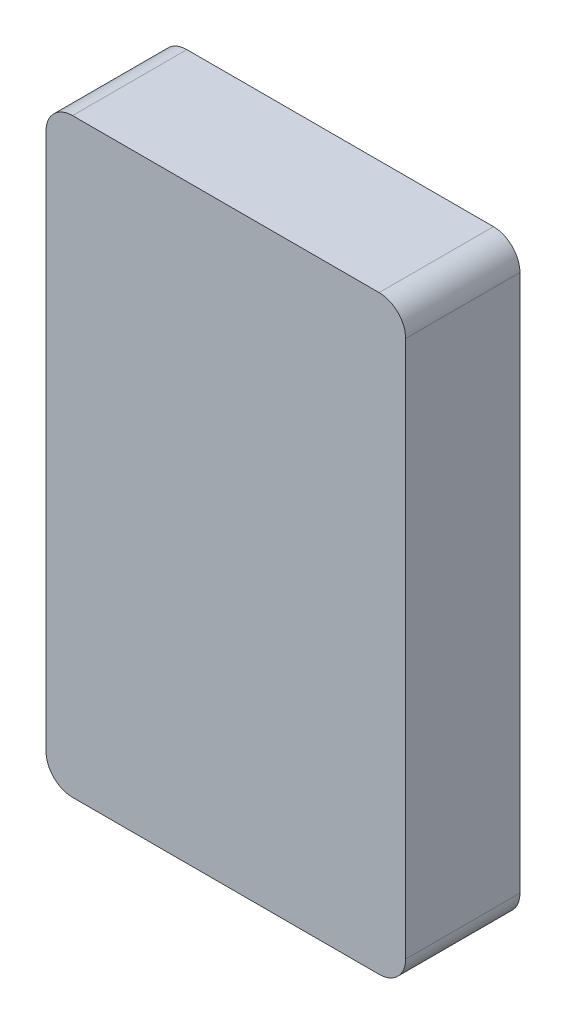
ISO-10303-21;
HEADER;
FILE_DESCRIPTION(('STEP AP214'),'2;1');
FILE_NAME('part.step','',(''),(''),'','','');
FILE_SCHEMA(('AUTOMOTIVE_DESIGN { 1 0 10303 214 1 1 1 1 }'));
ENDSEC;
DATA;
#1=APPLICATION_CONTEXT('core data for automotive mechanical design processes');
#2=APPLICATION_PROTOCOL_DEFINITION('international standard','automotive_design',2000,#1);
#3=PRODUCT_CONTEXT('',#1,'mechanical');
#4=PRODUCT('Part','Part','',(#3));
#5=PRODUCT_RELATED_PRODUCT_CATEGORY('part','',(#4));
#6=PRODUCT_DEFINITION_FORMATION('','',#4);
#7=PRODUCT_DEFINITION_CONTEXT('part definition',#1,'design');
#8=PRODUCT_DEFINITION('design','',#6,#7);
#9=PRODUCT_DEFINITION_SHAPE('','',#8);
#10=(LENGTH_UNIT() NAMED_UNIT(*) SI_UNIT(.MILLI.,.METRE.));
#11=(NAMED_UNIT(*) PLANE_ANGLE_UNIT() SI_UNIT($,.RADIAN.));
#12=(NAMED_UNIT(*) SI_UNIT($,.STERADIAN.) SOLID_ANGLE_UNIT());
#13=UNCERTAINTY_MEASURE_WITH_UNIT(LENGTH_MEASURE(1.E-05),#10,'distance_accuracy_value','');
#14=(GEOMETRIC_REPRESENTATION_CONTEXT(3) GLOBAL_UNCERTAINTY_ASSIGNED_CONTEXT((#13)) GLOBAL_UNIT_ASSIGNED_CONTEXT((#10,
#11,#12)) REPRESENTATION_CONTEXT('',''));
#15=CARTESIAN_POINT('',(0.,0.,0.));
#16=DIRECTION('',(0.,0.,1.));
#17=DIRECTION('',(1.,0.,0.));
#18=AXIS2_PLACEMENT_3D('',#15,#16,#17);
#19=CARTESIAN_POINT('',(-400.,-5.,0.));
#20=DIRECTION('',(0.,0.,1.));
#21=DIRECTION('',(1.,0.,0.));
#22=AXIS2_PLACEMENT_3D('',#19,#20,#21);
#23=PLANE('',#22);
#24=CARTESIAN_POINT('',(-400.,-5.,0.));
#25=DIRECTION('',(0.,0.,1.));
#26=DIRECTION('',(1.,0.,0.));
#27=AXIS2_PLACEMENT_3D('',#24,#25,#26);
#28=CIRCLE('',#27,35.);
#29=CARTESIAN_POINT('',(-435.,-5.00000000000001,0.));
#30=VERTEX_POINT('',#29);
#31=CARTESIAN_POINT('',(-400.,-40.,0.));
#32=VERTEX_POINT('',#31);
#33=EDGE_CURVE('E196',#30,#32,#28,.T.);
#34=ORIENTED_EDGE('',*,*,#33,.F.);
#35=DIRECTION('',(0.,-1.,0.));
#36=VECTOR('',#35,1.);
#37=CARTESIAN_POINT('',(-435.,705.,0.));
#38=LINE('',#37,#36);
#39=CARTESIAN_POINT('',(-435.,705.,0.));
#40=VERTEX_POINT('',#39);
#41=EDGE_CURVE('E56',#40,#30,#38,.T.);
#42=ORIENTED_EDGE('',*,*,#41,.F.);
#43=CARTESIAN_POINT('',(-400.,705.,0.));
#44=DIRECTION('',(0.,0.,1.));
#45=DIRECTION('',(1.,0.,0.));
#46=AXIS2_PLACEMENT_3D('',#43,#44,#45);
#47=CIRCLE('',#46,35.0000000000001);
#48=CARTESIAN_POINT('',(-400.,740.,0.));
#49=VERTEX_POINT('',#48);
#50=EDGE_CURVE('E208',#49,#40,#47,.T.);
#51=ORIENTED_EDGE('',*,*,#50,.F.);
#52=DIRECTION('',(-1.,0.,0.));
#53=VECTOR('',#52,1.);
#54=CARTESIAN_POINT('',(-400.,740.,0.));
#55=LINE('',#54,#53);
#56=CARTESIAN_POINT('',(5.,740.,0.));
#57=VERTEX_POINT('',#56);
#58=EDGE_CURVE('E206',#57,#49,#55,.T.);
#59=ORIENTED_EDGE('',*,*,#58,.F.);
#60=CARTESIAN_POINT('',(5.,705.,0.));
#61=DIRECTION('',(0.,0.,1.));
#62=DIRECTION('',(-1.,0.,0.));
#63=AXIS2_PLACEMENT_3D('',#60,#61,#62);
#64=CIRCLE('',#63,35.0000000000001);
#65=CARTESIAN_POINT('',(40.0000000000001,705.,0.));
#66=VERTEX_POINT('',#65);
#67=EDGE_CURVE('E204',#66,#57,#64,.T.);
#68=ORIENTED_EDGE('',*,*,#67,.F.);
#69=DIRECTION('',(0.,1.,0.));
#70=VECTOR('',#69,1.);
#71=CARTESIAN_POINT('',(40.,705.,0.));
#72=LINE('',#71,#70);
#73=CARTESIAN_POINT('',(40.0000000000001,-5.00000000000005,0.));
#74=VERTEX_POINT('',#73);
#75=EDGE_CURVE('E202',#74,#66,#72,.T.);
#76=ORIENTED_EDGE('',*,*,#75,.F.);
#77=CARTESIAN_POINT('',(5.00000000000012,-5.00000000000005,0.));
#78=DIRECTION('',(0.,0.,1.));
#79=DIRECTION('',(1.,0.,0.));
#80=AXIS2_PLACEMENT_3D('',#77,#78,#79);
#81=CIRCLE('',#80,35.);
#82=CARTESIAN_POINT('',(5.00000000000011,-40.,0.));
#83=VERTEX_POINT('',#82);
#84=EDGE_CURVE('E132',#83,#74,#81,.T.);
#85=ORIENTED_EDGE('',*,*,#84,.F.);
#86=DIRECTION('',(1.,0.,0.));
#87=VECTOR('',#86,1.);
#88=CARTESIAN_POINT('',(-400.,-40.,0.));
#89=LINE('',#88,#87);
#90=EDGE_CURVE('E199',#32,#83,#89,.T.);
#91=ORIENTED_EDGE('',*,*,#90,.F.);
#92=EDGE_LOOP('',(#34,#42,#51,#59,#68,#76,#85,#91));
#93=FACE_BOUND('',#92,.T.);
#94=DIRECTION('',(0.,1.,0.));
#95=VECTOR('',#94,1.);
#96=CARTESIAN_POINT('',(0.,0.,0.));
#97=LINE('',#96,#95);
#98=CARTESIAN_POINT('',(0.,0.,0.));
#99=VERTEX_POINT('',#98);
#100=CARTESIAN_POINT('',(0.,700.,0.));
#101=VERTEX_POINT('',#100);
#102=EDGE_CURVE('E48',#99,#101,#97,.T.);
#103=ORIENTED_EDGE('',*,*,#102,.T.);
#104=DIRECTION('',(-1.,0.,0.));
#105=VECTOR('',#104,1.);
#106=CARTESIAN_POINT('',(0.,700.,0.));
#107=LINE('',#106,#105);
#108=CARTESIAN_POINT('',(-395.,700.,0.));
#109=VERTEX_POINT('',#108);
#110=EDGE_CURVE('E181',#101,#109,#107,.T.);
#111=ORIENTED_EDGE('',*,*,#110,.T.);
#112=DIRECTION('',(0.,-1.,0.));
#113=VECTOR('',#112,1.);
#114=CARTESIAN_POINT('',(-395.,0.,0.));
#115=LINE('',#114,#113);
#116=CARTESIAN_POINT('',(-395.,0.,0.));
#117=VERTEX_POINT('',#116);
#118=EDGE_CURVE('E184',#109,#117,#115,.T.);
#119=ORIENTED_EDGE('',*,*,#118,.T.);
#120=DIRECTION('',(1.,0.,0.));
#121=VECTOR('',#120,1.);
#122=CARTESIAN_POINT('',(0.,0.,0.));
#123=LINE('',#122,#121);
#124=EDGE_CURVE('E170',#117,#99,#123,.T.);
#125=ORIENTED_EDGE('',*,*,#124,.T.);
#126=EDGE_LOOP('',(#103,#111,#119,#125));
#127=FACE_BOUND('',#126,.T.);
#128=ADVANCED_FACE('F33',(#93,#127),#23,.F.);
#129=CARTESIAN_POINT('',(-400.,-5.,150.));
#130=DIRECTION('',(0.,0.,-1.));
#131=DIRECTION('',(-1.,0.,0.));
#132=AXIS2_PLACEMENT_3D('',#129,#130,#131);
#133=CYLINDRICAL_SURFACE('',#132,35.);
#134=ORIENTED_EDGE('',*,*,#33,.T.);
#135=DIRECTION('',(0.,0.,-1.));
#136=VECTOR('',#135,1.);
#137=CARTESIAN_POINT('',(-400.,-40.,150.));
#138=LINE('',#137,#136);
#139=CARTESIAN_POINT('',(-400.,-40.,151.));
#140=VERTEX_POINT('',#139);
#141=EDGE_CURVE('E11',#140,#32,#138,.T.);
#142=ORIENTED_EDGE('',*,*,#141,.F.);
#143=CARTESIAN_POINT('',(-400.,-5.,151.));
#144=DIRECTION('',(0.,0.,1.));
#145=DIRECTION('',(1.,0.,0.));
#146=AXIS2_PLACEMENT_3D('',#143,#144,#145);
#147=CIRCLE('',#146,35.);
#148=CARTESIAN_POINT('',(-435.,-5.,151.));
#149=VERTEX_POINT('',#148);
#150=EDGE_CURVE('E163',#149,#140,#147,.T.);
#151=ORIENTED_EDGE('',*,*,#150,.F.);
#152=DIRECTION('',(0.,0.,-1.));
#153=VECTOR('',#152,1.);
#154=CARTESIAN_POINT('',(-435.,-5.00000000000001,150.));
#155=LINE('',#154,#153);
#156=EDGE_CURVE('E211',#149,#30,#155,.T.);
#157=ORIENTED_EDGE('',*,*,#156,.T.);
#158=EDGE_LOOP('',(#134,#142,#151,#157));
#159=FACE_BOUND('',#158,.T.);
#160=ADVANCED_FACE('F35',(#159),#133,.T.);
#161=CARTESIAN_POINT('',(-400.,-40.,150.));
#162=DIRECTION('',(0.,1.,0.));
#163=DIRECTION('',(-1.,0.,0.));
#164=AXIS2_PLACEMENT_3D('',#161,#162,#163);
#165=PLANE('',#164);
#166=ORIENTED_EDGE('',*,*,#90,.T.);
#167=DIRECTION('',(0.,0.,-1.));
#168=VECTOR('',#167,1.);
#169=CARTESIAN_POINT('',(5.00000000000011,-40.,150.));
#170=LINE('',#169,#168);
#171=CARTESIAN_POINT('',(5.00000000000011,-40.,151.));
#172=VERTEX_POINT('',#171);
#173=EDGE_CURVE('E41',#172,#83,#170,.T.);
#174=ORIENTED_EDGE('',*,*,#173,.F.);
#175=DIRECTION('',(1.,0.,0.));
#176=VECTOR('',#175,1.);
#177=CARTESIAN_POINT('',(-400.,-40.,151.));
#178=LINE('',#177,#176);
#179=EDGE_CURVE('E150',#140,#172,#178,.T.);
#180=ORIENTED_EDGE('',*,*,#179,.F.);
#181=ORIENTED_EDGE('',*,*,#141,.T.);
#182=EDGE_LOOP('',(#166,#174,#180,#181));
#183=FACE_BOUND('',#182,.T.);
#184=ADVANCED_FACE('F240',(#183),#165,.F.);
#185=CARTESIAN_POINT('',(5.00000000000012,-5.00000000000005,150.));
#186=DIRECTION('',(0.,0.,-1.));
#187=DIRECTION('',(-1.,0.,0.));
#188=AXIS2_PLACEMENT_3D('',#185,#186,#187);
#189=CYLINDRICAL_SURFACE('',#188,35.);
#190=ORIENTED_EDGE('',*,*,#84,.T.);
#191=DIRECTION('',(0.,0.,-1.));
#192=VECTOR('',#191,1.);
#193=CARTESIAN_POINT('',(40.0000000000001,-5.00000000000005,150.));
#194=LINE('',#193,#192);
#195=CARTESIAN_POINT('',(40.0000000000001,-5.00000000000005,151.));
#196=VERTEX_POINT('',#195);
#197=EDGE_CURVE('E125',#196,#74,#194,.T.);
#198=ORIENTED_EDGE('',*,*,#197,.F.);
#199=CARTESIAN_POINT('',(5.00000000000012,-5.00000000000005,151.));
#200=DIRECTION('',(0.,0.,1.));
#201=DIRECTION('',(1.,0.,0.));
#202=AXIS2_PLACEMENT_3D('',#199,#200,#201);
#203=CIRCLE('',#202,35.);
#204=EDGE_CURVE('E130',#172,#196,#203,.T.);
#205=ORIENTED_EDGE('',*,*,#204,.F.);
#206=ORIENTED_EDGE('',*,*,#173,.T.);
#207=EDGE_LOOP('',(#190,#198,#205,#206));
#208=FACE_BOUND('',#207,.T.);
#209=ADVANCED_FACE('F127',(#208),#189,.T.);
#210=CARTESIAN_POINT('',(40.,705.,150.));
#211=DIRECTION('',(-1.,0.,0.));
#212=DIRECTION('',(0.,-1.,0.));
#213=AXIS2_PLACEMENT_3D('',#210,#211,#212);
#214=PLANE('',#213);
#215=ORIENTED_EDGE('',*,*,#75,.T.);
#216=DIRECTION('',(0.,0.,-1.));
#217=VECTOR('',#216,1.);
#218=CARTESIAN_POINT('',(40.0000000000001,705.,150.));
#219=LINE('',#218,#217);
#220=CARTESIAN_POINT('',(40.0000000000001,705.,151.));
#221=VERTEX_POINT('',#220);
#222=EDGE_CURVE('E135',#221,#66,#219,.T.);
#223=ORIENTED_EDGE('',*,*,#222,.F.);
#224=DIRECTION('',(0.,1.,0.));
#225=VECTOR('',#224,1.);
#226=CARTESIAN_POINT('',(40.0000000000001,-5.00000000000005,151.));
#227=LINE('',#226,#225);
#228=EDGE_CURVE('E138',#196,#221,#227,.T.);
#229=ORIENTED_EDGE('',*,*,#228,.F.);
#230=ORIENTED_EDGE('',*,*,#197,.T.);
#231=EDGE_LOOP('',(#215,#223,#229,#230));
#232=FACE_BOUND('',#231,.T.);
#233=ADVANCED_FACE('F139',(#232),#214,.F.);
#234=CARTESIAN_POINT('',(5.,705.,150.));
#235=DIRECTION('',(0.,0.,-1.));
#236=DIRECTION('',(-1.,0.,0.));
#237=AXIS2_PLACEMENT_3D('',#234,#235,#236);
#238=CYLINDRICAL_SURFACE('',#237,35.0000000000001);
#239=ORIENTED_EDGE('',*,*,#67,.T.);
#240=DIRECTION('',(0.,0.,-1.));
#241=VECTOR('',#240,1.);
#242=CARTESIAN_POINT('',(5.,740.,150.));
#243=LINE('',#242,#241);
#244=CARTESIAN_POINT('',(5.,740.,151.));
#245=VERTEX_POINT('',#244);
#246=EDGE_CURVE('E218',#245,#57,#243,.T.);
#247=ORIENTED_EDGE('',*,*,#246,.F.);
#248=CARTESIAN_POINT('',(5.,705.,151.));
#249=DIRECTION('',(0.,0.,1.));
#250=DIRECTION('',(1.,0.,0.));
#251=AXIS2_PLACEMENT_3D('',#248,#249,#250);
#252=CIRCLE('',#251,35.0000000000001);
#253=EDGE_CURVE('E144',#221,#245,#252,.T.);
#254=ORIENTED_EDGE('',*,*,#253,.F.);
#255=ORIENTED_EDGE('',*,*,#222,.T.);
#256=EDGE_LOOP('',(#239,#247,#254,#255));
#257=FACE_BOUND('',#256,.T.);
#258=ADVANCED_FACE('F228',(#257),#238,.T.);
#259=CARTESIAN_POINT('',(-400.,740.,150.));
#260=DIRECTION('',(0.,-1.,0.));
#261=DIRECTION('',(0.,0.,-1.));
#262=AXIS2_PLACEMENT_3D('',#259,#260,#261);
#263=PLANE('',#262);
#264=ORIENTED_EDGE('',*,*,#58,.T.);
#265=DIRECTION('',(0.,0.,-1.));
#266=VECTOR('',#265,1.);
#267=CARTESIAN_POINT('',(-400.,740.,150.));
#268=LINE('',#267,#266);
#269=CARTESIAN_POINT('',(-400.,740.,151.));
#270=VERTEX_POINT('',#269);
#271=EDGE_CURVE('E215',#270,#49,#268,.T.);
#272=ORIENTED_EDGE('',*,*,#271,.F.);
#273=DIRECTION('',(-1.,0.,0.));
#274=VECTOR('',#273,1.);
#275=CARTESIAN_POINT('',(5.,740.,151.));
#276=LINE('',#275,#274);
#277=EDGE_CURVE('E154',#245,#270,#276,.T.);
#278=ORIENTED_EDGE('',*,*,#277,.F.);
#279=ORIENTED_EDGE('',*,*,#246,.T.);
#280=EDGE_LOOP('',(#264,#272,#278,#279));
#281=FACE_BOUND('',#280,.T.);
#282=ADVANCED_FACE('F232',(#281),#263,.F.);
#283=CARTESIAN_POINT('',(-400.,705.,150.));
#284=DIRECTION('',(0.,0.,-1.));
#285=DIRECTION('',(-1.,0.,0.));
#286=AXIS2_PLACEMENT_3D('',#283,#284,#285);
#287=CYLINDRICAL_SURFACE('',#286,35.0000000000001);
#288=ORIENTED_EDGE('',*,*,#50,.T.);
#289=DIRECTION('',(0.,0.,-1.));
#290=VECTOR('',#289,1.);
#291=CARTESIAN_POINT('',(-435.,705.,150.));
#292=LINE('',#291,#290);
#293=CARTESIAN_POINT('',(-435.,705.,151.));
#294=VERTEX_POINT('',#293);
#295=EDGE_CURVE('E213',#294,#40,#292,.T.);
#296=ORIENTED_EDGE('',*,*,#295,.F.);
#297=CARTESIAN_POINT('',(-400.,705.,151.));
#298=DIRECTION('',(0.,0.,1.));
#299=DIRECTION('',(1.,0.,0.));
#300=AXIS2_PLACEMENT_3D('',#297,#298,#299);
#301=CIRCLE('',#300,35.);
#302=EDGE_CURVE('E157',#270,#294,#301,.T.);
#303=ORIENTED_EDGE('',*,*,#302,.F.);
#304=ORIENTED_EDGE('',*,*,#271,.T.);
#305=EDGE_LOOP('',(#288,#296,#303,#304));
#306=FACE_BOUND('',#305,.T.);
#307=ADVANCED_FACE('F235',(#306),#287,.T.);
#308=CARTESIAN_POINT('',(-435.,705.,150.));
#309=DIRECTION('',(1.,0.,0.));
#310=DIRECTION('',(0.,1.,0.));
#311=AXIS2_PLACEMENT_3D('',#308,#309,#310);
#312=PLANE('',#311);
#313=ORIENTED_EDGE('',*,*,#41,.T.);
#314=ORIENTED_EDGE('',*,*,#156,.F.);
#315=DIRECTION('',(0.,-1.,0.));
#316=VECTOR('',#315,1.);
#317=CARTESIAN_POINT('',(-435.,705.,151.));
#318=LINE('',#317,#316);
#319=EDGE_CURVE('E160',#294,#149,#318,.T.);
#320=ORIENTED_EDGE('',*,*,#319,.F.);
#321=ORIENTED_EDGE('',*,*,#295,.T.);
#322=EDGE_LOOP('',(#313,#314,#320,#321));
#323=FACE_BOUND('',#322,.T.);
#324=ADVANCED_FACE('F239',(#323),#312,.F.);
#325=CARTESIAN_POINT('',(0.,0.,150.));
#326=DIRECTION('',(-1.,0.,0.));
#327=DIRECTION('',(0.,0.,1.));
#328=AXIS2_PLACEMENT_3D('',#325,#326,#327);
#329=PLANE('',#328);
#330=ORIENTED_EDGE('',*,*,#102,.F.);
#331=DIRECTION('',(0.,0.,-1.));
#332=VECTOR('',#331,1.);
#333=CARTESIAN_POINT('',(0.,0.,150.));
#334=LINE('',#333,#332);
#335=CARTESIAN_POINT('',(0.,0.,150.));
#336=VERTEX_POINT('',#335);
#337=EDGE_CURVE('E179',#336,#99,#334,.T.);
#338=ORIENTED_EDGE('',*,*,#337,.F.);
#339=DIRECTION('',(0.,1.,0.));
#340=VECTOR('',#339,1.);
#341=CARTESIAN_POINT('',(0.,0.,150.));
#342=LINE('',#341,#340);
#343=CARTESIAN_POINT('',(0.,700.,150.));
#344=VERTEX_POINT('',#343);
#345=EDGE_CURVE('E166',#336,#344,#342,.T.);
#346=ORIENTED_EDGE('',*,*,#345,.T.);
#347=DIRECTION('',(0.,0.,-1.));
#348=VECTOR('',#347,1.);
#349=CARTESIAN_POINT('',(0.,700.,150.));
#350=LINE('',#349,#348);
#351=EDGE_CURVE('E194',#344,#101,#350,.T.);
#352=ORIENTED_EDGE('',*,*,#351,.T.);
#353=EDGE_LOOP('',(#330,#338,#346,#352));
#354=FACE_BOUND('',#353,.T.);
#355=ADVANCED_FACE('F253',(#354),#329,.T.);
#356=CARTESIAN_POINT('',(0.,700.,150.));
#357=DIRECTION('',(0.,-1.,0.));
#358=DIRECTION('',(0.,0.,-1.));
#359=AXIS2_PLACEMENT_3D('',#356,#357,#358);
#360=PLANE('',#359);
#361=ORIENTED_EDGE('',*,*,#110,.F.);
#362=ORIENTED_EDGE('',*,*,#351,.F.);
#363=DIRECTION('',(-1.,0.,0.));
#364=VECTOR('',#363,1.);
#365=CARTESIAN_POINT('',(0.,700.,150.));
#366=LINE('',#365,#364);
#367=CARTESIAN_POINT('',(-395.,700.,150.));
#368=VERTEX_POINT('',#367);
#369=EDGE_CURVE('E169',#344,#368,#366,.T.);
#370=ORIENTED_EDGE('',*,*,#369,.T.);
#371=DIRECTION('',(0.,0.,-1.));
#372=VECTOR('',#371,1.);
#373=CARTESIAN_POINT('',(-395.,700.,150.));
#374=LINE('',#373,#372);
#375=EDGE_CURVE('E192',#368,#109,#374,.T.);
#376=ORIENTED_EDGE('',*,*,#375,.T.);
#377=EDGE_LOOP('',(#361,#362,#370,#376));
#378=FACE_BOUND('',#377,.T.);
#379=ADVANCED_FACE('F290',(#378),#360,.T.);
#380=CARTESIAN_POINT('',(-395.,0.,150.));
#381=DIRECTION('',(1.,0.,0.));
#382=DIRECTION('',(0.,0.,-1.));
#383=AXIS2_PLACEMENT_3D('',#380,#381,#382);
#384=PLANE('',#383);
#385=ORIENTED_EDGE('',*,*,#118,.F.);
#386=ORIENTED_EDGE('',*,*,#375,.F.);
#387=DIRECTION('',(0.,-1.,0.));
#388=VECTOR('',#387,1.);
#389=CARTESIAN_POINT('',(-395.,0.,150.));
#390=LINE('',#389,#388);
#391=CARTESIAN_POINT('',(-395.,0.,150.));
#392=VERTEX_POINT('',#391);
#393=EDGE_CURVE('E173',#368,#392,#390,.T.);
#394=ORIENTED_EDGE('',*,*,#393,.T.);
#395=DIRECTION('',(0.,0.,-1.));
#396=VECTOR('',#395,1.);
#397=CARTESIAN_POINT('',(-395.,0.,150.));
#398=LINE('',#397,#396);
#399=EDGE_CURVE('E190',#392,#117,#398,.T.);
#400=ORIENTED_EDGE('',*,*,#399,.T.);
#401=EDGE_LOOP('',(#385,#386,#394,#400));
#402=FACE_BOUND('',#401,.T.);
#403=ADVANCED_FACE('F296',(#402),#384,.T.);
#404=CARTESIAN_POINT('',(0.,0.,150.));
#405=DIRECTION('',(0.,1.,0.));
#406=DIRECTION('',(0.,0.,1.));
#407=AXIS2_PLACEMENT_3D('',#404,#405,#406);
#408=PLANE('',#407);
#409=ORIENTED_EDGE('',*,*,#124,.F.);
#410=ORIENTED_EDGE('',*,*,#399,.F.);
#411=DIRECTION('',(1.,0.,0.));
#412=VECTOR('',#411,1.);
#413=CARTESIAN_POINT('',(0.,0.,150.));
#414=LINE('',#413,#412);
#415=EDGE_CURVE('E176',#392,#336,#414,.T.);
#416=ORIENTED_EDGE('',*,*,#415,.T.);
#417=ORIENTED_EDGE('',*,*,#337,.T.);
#418=EDGE_LOOP('',(#409,#410,#416,#417));
#419=FACE_BOUND('',#418,.T.);
#420=ADVANCED_FACE('F303',(#419),#408,.T.);
#421=CARTESIAN_POINT('',(5.00000000000012,-5.00000000000005,150.));
#422=DIRECTION('',(0.,0.,1.));
#423=DIRECTION('',(1.,0.,0.));
#424=AXIS2_PLACEMENT_3D('',#421,#422,#423);
#425=PLANE('',#424);
#426=ORIENTED_EDGE('',*,*,#345,.F.);
#427=ORIENTED_EDGE('',*,*,#415,.F.);
#428=ORIENTED_EDGE('',*,*,#393,.F.);
#429=ORIENTED_EDGE('',*,*,#369,.F.);
#430=EDGE_LOOP('',(#426,#427,#428,#429));
#431=FACE_BOUND('',#430,.T.);
#432=ADVANCED_FACE('F311',(#431),#425,.F.);
#433=CARTESIAN_POINT('',(5.00000000000012,-5.00000000000005,151.));
#434=DIRECTION('',(0.,0.,1.));
#435=DIRECTION('',(1.,0.,0.));
#436=AXIS2_PLACEMENT_3D('',#433,#434,#435);
#437=PLANE('',#436);
#438=ORIENTED_EDGE('',*,*,#204,.T.);
#439=ORIENTED_EDGE('',*,*,#228,.T.);
#440=ORIENTED_EDGE('',*,*,#253,.T.);
#441=ORIENTED_EDGE('',*,*,#277,.T.);
#442=ORIENTED_EDGE('',*,*,#302,.T.);
#443=ORIENTED_EDGE('',*,*,#319,.T.);
#444=ORIENTED_EDGE('',*,*,#150,.T.);
#445=ORIENTED_EDGE('',*,*,#179,.T.);
#446=EDGE_LOOP('',(#438,#439,#440,#441,#442,#443,#444,#445));
#447=FACE_BOUND('',#446,.T.);
#448=ADVANCED_FACE('F147',(#447),#437,.T.);
#449=CLOSED_SHELL('',(#128,#160,#184,#209,#233,#258,#282,#307,#324,#355,#379,#403,#420,#432,#448));
#450=MANIFOLD_SOLID_BREP('B2',#449);
#451=ADVANCED_BREP_SHAPE_REPRESENTATION('',(#18,#450),#14);
#452=SHAPE_DEFINITION_REPRESENTATION(#9,#451);
ENDSEC;
END-ISO-10303-21;
